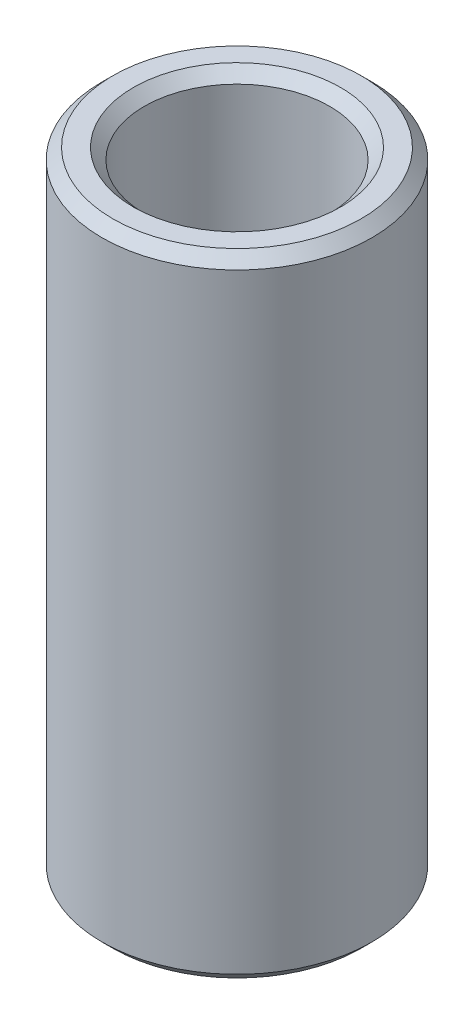
ISO-10303-21;
HEADER;
FILE_DESCRIPTION(('STEP AP214'),'2;1');
FILE_NAME('part.step','',(''),(''),'','','');
FILE_SCHEMA(('AUTOMOTIVE_DESIGN { 1 0 10303 214 1 1 1 1 }'));
ENDSEC;
DATA;
#1=APPLICATION_CONTEXT('core data for automotive mechanical design processes');
#2=APPLICATION_PROTOCOL_DEFINITION('international standard','automotive_design',2000,#1);
#3=PRODUCT_CONTEXT('',#1,'mechanical');
#4=PRODUCT('Part','Part','',(#3));
#5=PRODUCT_RELATED_PRODUCT_CATEGORY('part','',(#4));
#6=PRODUCT_DEFINITION_FORMATION('','',#4);
#7=PRODUCT_DEFINITION_CONTEXT('part definition',#1,'design');
#8=PRODUCT_DEFINITION('design','',#6,#7);
#9=PRODUCT_DEFINITION_SHAPE('','',#8);
#10=(LENGTH_UNIT() NAMED_UNIT(*) SI_UNIT(.MILLI.,.METRE.));
#11=(NAMED_UNIT(*) PLANE_ANGLE_UNIT() SI_UNIT($,.RADIAN.));
#12=(NAMED_UNIT(*) SI_UNIT($,.STERADIAN.) SOLID_ANGLE_UNIT());
#13=UNCERTAINTY_MEASURE_WITH_UNIT(LENGTH_MEASURE(1.E-05),#10,'distance_accuracy_value','');
#14=(GEOMETRIC_REPRESENTATION_CONTEXT(3) GLOBAL_UNCERTAINTY_ASSIGNED_CONTEXT((#13)) GLOBAL_UNIT_ASSIGNED_CONTEXT((#10,
#11,#12)) REPRESENTATION_CONTEXT('',''));
#15=CARTESIAN_POINT('',(0.,0.,0.));
#16=DIRECTION('',(0.,0.,1.));
#17=DIRECTION('',(1.,0.,0.));
#18=AXIS2_PLACEMENT_3D('',#15,#16,#17);
#19=CARTESIAN_POINT('',(0.,210.61207364757,0.));
#20=DIRECTION('',(0.,-1.,0.));
#21=DIRECTION('',(0.,0.,-1.));
#22=AXIS2_PLACEMENT_3D('',#19,#20,#21);
#23=CYLINDRICAL_SURFACE('',#22,45.);
#24=CARTESIAN_POINT('',(0.,3.63114305362353,0.));
#25=DIRECTION('',(0.,1.,0.));
#26=DIRECTION('',(0.,0.,1.));
#27=AXIS2_PLACEMENT_3D('',#24,#25,#26);
#28=CIRCLE('',#27,45.);
#29=CARTESIAN_POINT('',(0.,3.63114305362353,45.));
#30=VERTEX_POINT('',#29);
#31=EDGE_CURVE('E10',#30,#30,#28,.T.);
#32=ORIENTED_EDGE('',*,*,#31,.T.);
#33=EDGE_LOOP('',(#32));
#34=FACE_BOUND('',#33,.T.);
#35=CARTESIAN_POINT('',(0.,206.980930593946,0.));
#36=DIRECTION('',(0.,1.,0.));
#37=DIRECTION('',(0.,0.,1.));
#38=AXIS2_PLACEMENT_3D('',#35,#36,#37);
#39=CIRCLE('',#38,45.);
#40=CARTESIAN_POINT('',(0.,206.980930593946,45.));
#41=VERTEX_POINT('',#40);
#42=EDGE_CURVE('E50',#41,#41,#39,.F.);
#43=ORIENTED_EDGE('',*,*,#42,.T.);
#44=EDGE_LOOP('',(#43));
#45=FACE_BOUND('',#44,.T.);
#46=ADVANCED_FACE('F39',(#34,#45),#23,.T.);
#47=CARTESIAN_POINT('',(0.,210.61207364757,0.));
#48=DIRECTION('',(0.,1.,0.));
#49=DIRECTION('',(0.,0.,1.));
#50=AXIS2_PLACEMENT_3D('',#47,#48,#49);
#51=PLANE('',#50);
#52=CARTESIAN_POINT('',(0.,210.61207364757,0.));
#53=DIRECTION('',(0.,1.,0.));
#54=DIRECTION('',(0.,0.,1.));
#55=AXIS2_PLACEMENT_3D('',#52,#53,#54);
#56=CIRCLE('',#55,34.5457393581179);
#57=CARTESIAN_POINT('',(0.,210.61207364757,34.5457393581179));
#58=VERTEX_POINT('',#57);
#59=EDGE_CURVE('E58',#58,#58,#56,.F.);
#60=ORIENTED_EDGE('',*,*,#59,.T.);
#61=EDGE_LOOP('',(#60));
#62=FACE_BOUND('',#61,.T.);
#63=CARTESIAN_POINT('',(0.,210.61207364757,0.));
#64=DIRECTION('',(0.,1.,0.));
#65=DIRECTION('',(0.,0.,1.));
#66=AXIS2_PLACEMENT_3D('',#63,#64,#65);
#67=CIRCLE('',#66,41.3688569463765);
#68=CARTESIAN_POINT('',(0.,210.61207364757,41.3688569463765));
#69=VERTEX_POINT('',#68);
#70=EDGE_CURVE('E61',#69,#69,#67,.T.);
#71=ORIENTED_EDGE('',*,*,#70,.T.);
#72=EDGE_LOOP('',(#71));
#73=FACE_BOUND('',#72,.T.);
#74=ADVANCED_FACE('F88',(#62,#73),#51,.T.);
#75=CARTESIAN_POINT('',(0.,0.,0.));
#76=DIRECTION('',(0.,1.,0.));
#77=DIRECTION('',(0.,0.,1.));
#78=AXIS2_PLACEMENT_3D('',#75,#76,#77);
#79=PLANE('',#78);
#80=CARTESIAN_POINT('',(0.,0.,0.));
#81=DIRECTION('',(0.,1.,0.));
#82=DIRECTION('',(0.,0.,1.));
#83=AXIS2_PLACEMENT_3D('',#80,#81,#82);
#84=CIRCLE('',#83,34.545739358118);
#85=CARTESIAN_POINT('',(0.,0.,34.545739358118));
#86=VERTEX_POINT('',#85);
#87=EDGE_CURVE('E51',#86,#86,#84,.T.);
#88=ORIENTED_EDGE('',*,*,#87,.T.);
#89=EDGE_LOOP('',(#88));
#90=FACE_BOUND('',#89,.T.);
#91=CARTESIAN_POINT('',(0.,0.,0.));
#92=DIRECTION('',(0.,1.,0.));
#93=DIRECTION('',(0.,0.,1.));
#94=AXIS2_PLACEMENT_3D('',#91,#92,#93);
#95=CIRCLE('',#94,41.3688569463765);
#96=CARTESIAN_POINT('',(0.,0.,41.3688569463765));
#97=VERTEX_POINT('',#96);
#98=EDGE_CURVE('E54',#97,#97,#95,.F.);
#99=ORIENTED_EDGE('',*,*,#98,.T.);
#100=EDGE_LOOP('',(#99));
#101=FACE_BOUND('',#100,.T.);
#102=ADVANCED_FACE('F83',(#90,#101),#79,.F.);
#103=CARTESIAN_POINT('',(0.,210.61207364757,0.));
#104=DIRECTION('',(0.,-1.,0.));
#105=DIRECTION('',(0.,0.,-1.));
#106=AXIS2_PLACEMENT_3D('',#103,#104,#105);
#107=CYLINDRICAL_SURFACE('',#106,30.9145963044945);
#108=CARTESIAN_POINT('',(0.,206.980930593946,0.));
#109=DIRECTION('',(0.,1.,0.));
#110=DIRECTION('',(0.,0.,1.));
#111=AXIS2_PLACEMENT_3D('',#108,#109,#110);
#112=CIRCLE('',#111,30.9145963044945);
#113=CARTESIAN_POINT('',(0.,206.980930593946,30.9145963044945));
#114=VERTEX_POINT('',#113);
#115=EDGE_CURVE('E67',#114,#114,#112,.T.);
#116=ORIENTED_EDGE('',*,*,#115,.T.);
#117=EDGE_LOOP('',(#116));
#118=FACE_BOUND('',#117,.T.);
#119=CARTESIAN_POINT('',(0.,3.63114305362353,0.));
#120=DIRECTION('',(0.,1.,0.));
#121=DIRECTION('',(0.,0.,1.));
#122=AXIS2_PLACEMENT_3D('',#119,#120,#121);
#123=CIRCLE('',#122,30.9145963044945);
#124=CARTESIAN_POINT('',(0.,3.63114305362353,30.9145963044945));
#125=VERTEX_POINT('',#124);
#126=EDGE_CURVE('E69',#125,#125,#123,.F.);
#127=ORIENTED_EDGE('',*,*,#126,.T.);
#128=EDGE_LOOP('',(#127));
#129=FACE_BOUND('',#128,.T.);
#130=ADVANCED_FACE('F71',(#118,#129),#107,.F.);
#131=CARTESIAN_POINT('',(0.,206.980930593946,0.));
#132=DIRECTION('',(0.,1.,0.));
#133=DIRECTION('',(0.,0.,1.));
#134=AXIS2_PLACEMENT_3D('',#131,#132,#133);
#135=CONICAL_SURFACE('',#134,30.9145963044945,0.785398163397448);
#136=ORIENTED_EDGE('',*,*,#59,.F.);
#137=EDGE_LOOP('',(#136));
#138=FACE_BOUND('',#137,.T.);
#139=ORIENTED_EDGE('',*,*,#115,.F.);
#140=EDGE_LOOP('',(#139));
#141=FACE_BOUND('',#140,.T.);
#142=ADVANCED_FACE('F77',(#138,#141),#135,.F.);
#143=CARTESIAN_POINT('',(0.,0.,0.));
#144=DIRECTION('',(0.,-1.,0.));
#145=DIRECTION('',(0.,0.,-1.));
#146=AXIS2_PLACEMENT_3D('',#143,#144,#145);
#147=CONICAL_SURFACE('',#146,34.545739358118,0.785398163397445);
#148=ORIENTED_EDGE('',*,*,#126,.F.);
#149=EDGE_LOOP('',(#148));
#150=FACE_BOUND('',#149,.T.);
#151=ORIENTED_EDGE('',*,*,#87,.F.);
#152=EDGE_LOOP('',(#151));
#153=FACE_BOUND('',#152,.T.);
#154=ADVANCED_FACE('F73',(#150,#153),#147,.F.);
#155=CARTESIAN_POINT('',(0.,3.63114305362353,0.));
#156=DIRECTION('',(0.,1.,0.));
#157=DIRECTION('',(0.,0.,1.));
#158=AXIS2_PLACEMENT_3D('',#155,#156,#157);
#159=CONICAL_SURFACE('',#158,45.,0.785398163397448);
#160=ORIENTED_EDGE('',*,*,#98,.F.);
#161=EDGE_LOOP('',(#160));
#162=FACE_BOUND('',#161,.T.);
#163=ORIENTED_EDGE('',*,*,#31,.F.);
#164=EDGE_LOOP('',(#163));
#165=FACE_BOUND('',#164,.T.);
#166=ADVANCED_FACE('F76',(#162,#165),#159,.T.);
#167=CARTESIAN_POINT('',(0.,210.61207364757,0.));
#168=DIRECTION('',(0.,-1.,0.));
#169=DIRECTION('',(0.,0.,-1.));
#170=AXIS2_PLACEMENT_3D('',#167,#168,#169);
#171=CONICAL_SURFACE('',#170,41.3688569463765,0.785398163397446);
#172=ORIENTED_EDGE('',*,*,#42,.F.);
#173=EDGE_LOOP('',(#172));
#174=FACE_BOUND('',#173,.T.);
#175=ORIENTED_EDGE('',*,*,#70,.F.);
#176=EDGE_LOOP('',(#175));
#177=FACE_BOUND('',#176,.T.);
#178=ADVANCED_FACE('F45',(#174,#177),#171,.T.);
#179=CLOSED_SHELL('',(#46,#74,#102,#130,#142,#154,#166,#178));
#180=MANIFOLD_SOLID_BREP('B2',#179);
#181=ADVANCED_BREP_SHAPE_REPRESENTATION('',(#18,#180),#14);
#182=SHAPE_DEFINITION_REPRESENTATION(#9,#181);
ENDSEC;
END-ISO-10303-21;
